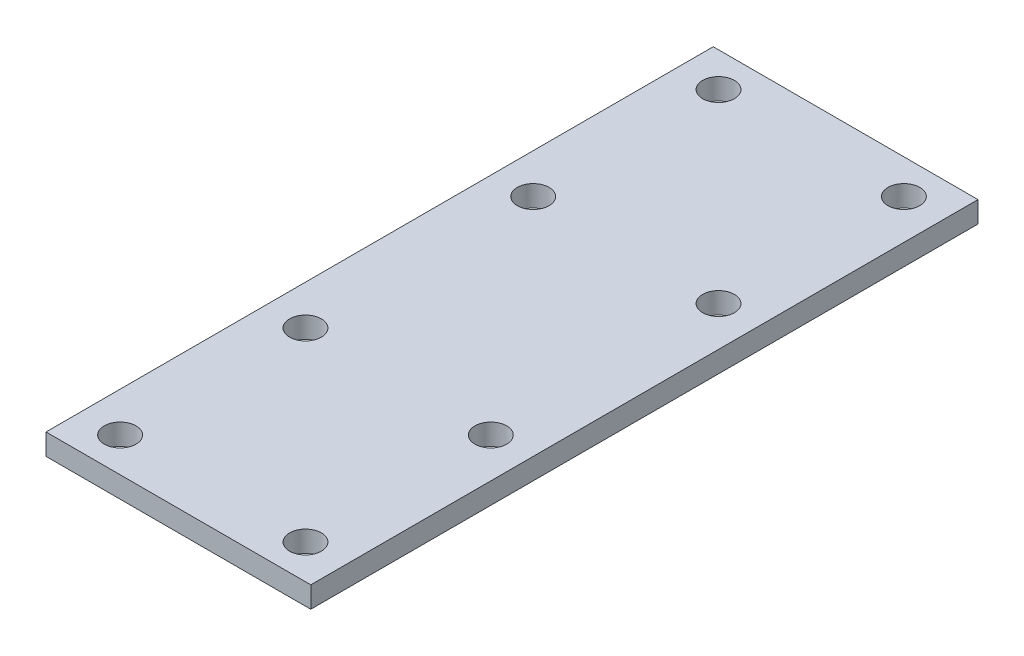
ISO-10303-21;
HEADER;
FILE_DESCRIPTION(('STEP AP214'),'2;1');
FILE_NAME('part.step','',(''),(''),'','','');
FILE_SCHEMA(('AUTOMOTIVE_DESIGN { 1 0 10303 214 1 1 1 1 }'));
ENDSEC;
DATA;
#1=APPLICATION_CONTEXT('core data for automotive mechanical design processes');
#2=APPLICATION_PROTOCOL_DEFINITION('international standard','automotive_design',2000,#1);
#3=PRODUCT_CONTEXT('',#1,'mechanical');
#4=PRODUCT('Part','Part','',(#3));
#5=PRODUCT_RELATED_PRODUCT_CATEGORY('part','',(#4));
#6=PRODUCT_DEFINITION_FORMATION('','',#4);
#7=PRODUCT_DEFINITION_CONTEXT('part definition',#1,'design');
#8=PRODUCT_DEFINITION('design','',#6,#7);
#9=PRODUCT_DEFINITION_SHAPE('','',#8);
#10=(LENGTH_UNIT() NAMED_UNIT(*) SI_UNIT(.MILLI.,.METRE.));
#11=(NAMED_UNIT(*) PLANE_ANGLE_UNIT() SI_UNIT($,.RADIAN.));
#12=(NAMED_UNIT(*) SI_UNIT($,.STERADIAN.) SOLID_ANGLE_UNIT());
#13=UNCERTAINTY_MEASURE_WITH_UNIT(LENGTH_MEASURE(1.E-05),#10,'distance_accuracy_value','');
#14=(GEOMETRIC_REPRESENTATION_CONTEXT(3) GLOBAL_UNCERTAINTY_ASSIGNED_CONTEXT((#13)) GLOBAL_UNIT_ASSIGNED_CONTEXT((#10,
#11,#12)) REPRESENTATION_CONTEXT('',''));
#15=CARTESIAN_POINT('',(0.,0.,0.));
#16=DIRECTION('',(0.,0.,1.));
#17=DIRECTION('',(1.,0.,0.));
#18=AXIS2_PLACEMENT_3D('',#15,#16,#17);
#19=CARTESIAN_POINT('',(0.,4.,0.));
#20=DIRECTION('',(0.,-1.,0.));
#21=DIRECTION('',(0.,0.,-1.));
#22=AXIS2_PLACEMENT_3D('',#19,#20,#21);
#23=PLANE('',#22);
#24=DIRECTION('',(0.,0.,1.));
#25=VECTOR('',#24,1.);
#26=CARTESIAN_POINT('',(0.,4.,0.));
#27=LINE('',#26,#25);
#28=CARTESIAN_POINT('',(0.,4.,-126.));
#29=VERTEX_POINT('',#28);
#30=CARTESIAN_POINT('',(0.,4.,0.));
#31=VERTEX_POINT('',#30);
#32=EDGE_CURVE('E89',#29,#31,#27,.T.);
#33=ORIENTED_EDGE('',*,*,#32,.T.);
#34=DIRECTION('',(1.,0.,0.));
#35=VECTOR('',#34,1.);
#36=CARTESIAN_POINT('',(0.,4.,0.));
#37=LINE('',#36,#35);
#38=CARTESIAN_POINT('',(50.,4.,0.));
#39=VERTEX_POINT('',#38);
#40=EDGE_CURVE('E84',#31,#39,#37,.T.);
#41=ORIENTED_EDGE('',*,*,#40,.T.);
#42=DIRECTION('',(0.,0.,-1.));
#43=VECTOR('',#42,1.);
#44=CARTESIAN_POINT('',(50.,4.,0.));
#45=LINE('',#44,#43);
#46=CARTESIAN_POINT('',(50.,4.,-126.));
#47=VERTEX_POINT('',#46);
#48=EDGE_CURVE('E87',#39,#47,#45,.T.);
#49=ORIENTED_EDGE('',*,*,#48,.T.);
#50=DIRECTION('',(-1.,0.,0.));
#51=VECTOR('',#50,1.);
#52=CARTESIAN_POINT('',(0.,4.,-126.));
#53=LINE('',#52,#51);
#54=EDGE_CURVE('E54',#47,#29,#53,.T.);
#55=ORIENTED_EDGE('',*,*,#54,.T.);
#56=EDGE_LOOP('',(#33,#41,#49,#55));
#57=FACE_BOUND('',#56,.T.);
#58=CARTESIAN_POINT('',(7.5,4.,-119.5));
#59=DIRECTION('',(0.,1.,0.));
#60=DIRECTION('',(0.,0.,1.));
#61=AXIS2_PLACEMENT_3D('',#58,#59,#60);
#62=CIRCLE('',#61,3.);
#63=CARTESIAN_POINT('',(7.5,4.,-116.5));
#64=VERTEX_POINT('',#63);
#65=EDGE_CURVE('E104',#64,#64,#62,.T.);
#66=ORIENTED_EDGE('',*,*,#65,.F.);
#67=EDGE_LOOP('',(#66));
#68=FACE_BOUND('',#67,.T.);
#69=CARTESIAN_POINT('',(7.50000000000001,4.,-84.5));
#70=DIRECTION('',(0.,1.,0.));
#71=DIRECTION('',(0.,0.,1.));
#72=AXIS2_PLACEMENT_3D('',#69,#70,#71);
#73=CIRCLE('',#72,3.);
#74=CARTESIAN_POINT('',(7.50000000000001,4.,-81.5));
#75=VERTEX_POINT('',#74);
#76=EDGE_CURVE('E119',#75,#75,#73,.T.);
#77=ORIENTED_EDGE('',*,*,#76,.F.);
#78=EDGE_LOOP('',(#77));
#79=FACE_BOUND('',#78,.T.);
#80=CARTESIAN_POINT('',(42.5,4.,-84.5));
#81=DIRECTION('',(0.,1.,0.));
#82=DIRECTION('',(0.,0.,-1.));
#83=AXIS2_PLACEMENT_3D('',#80,#81,#82);
#84=CIRCLE('',#83,2.99999999999999);
#85=CARTESIAN_POINT('',(42.5,4.,-87.5));
#86=VERTEX_POINT('',#85);
#87=EDGE_CURVE('E125',#86,#86,#84,.T.);
#88=ORIENTED_EDGE('',*,*,#87,.F.);
#89=EDGE_LOOP('',(#88));
#90=FACE_BOUND('',#89,.T.);
#91=CARTESIAN_POINT('',(42.5,4.,-119.5));
#92=DIRECTION('',(0.,1.,0.));
#93=DIRECTION('',(0.,0.,-1.));
#94=AXIS2_PLACEMENT_3D('',#91,#92,#93);
#95=CIRCLE('',#94,3.);
#96=CARTESIAN_POINT('',(42.5,4.,-122.5));
#97=VERTEX_POINT('',#96);
#98=EDGE_CURVE('E131',#97,#97,#95,.T.);
#99=ORIENTED_EDGE('',*,*,#98,.F.);
#100=EDGE_LOOP('',(#99));
#101=FACE_BOUND('',#100,.T.);
#102=CARTESIAN_POINT('',(7.50000000000001,4.,-41.5));
#103=DIRECTION('',(0.,1.,0.));
#104=DIRECTION('',(0.,0.,-1.));
#105=AXIS2_PLACEMENT_3D('',#102,#103,#104);
#106=CIRCLE('',#105,3.);
#107=CARTESIAN_POINT('',(7.50000000000001,4.,-44.5));
#108=VERTEX_POINT('',#107);
#109=EDGE_CURVE('E137',#108,#108,#106,.T.);
#110=ORIENTED_EDGE('',*,*,#109,.F.);
#111=EDGE_LOOP('',(#110));
#112=FACE_BOUND('',#111,.T.);
#113=CARTESIAN_POINT('',(7.5,4.,-6.50000000000001));
#114=DIRECTION('',(0.,1.,0.));
#115=DIRECTION('',(0.,0.,-1.));
#116=AXIS2_PLACEMENT_3D('',#113,#114,#115);
#117=CIRCLE('',#116,3.);
#118=CARTESIAN_POINT('',(7.5,4.,-9.50000000000001));
#119=VERTEX_POINT('',#118);
#120=EDGE_CURVE('E143',#119,#119,#117,.T.);
#121=ORIENTED_EDGE('',*,*,#120,.F.);
#122=EDGE_LOOP('',(#121));
#123=FACE_BOUND('',#122,.T.);
#124=CARTESIAN_POINT('',(42.5,4.,-6.50000000000001));
#125=DIRECTION('',(0.,1.,0.));
#126=DIRECTION('',(0.,0.,1.));
#127=AXIS2_PLACEMENT_3D('',#124,#125,#126);
#128=CIRCLE('',#127,3.);
#129=CARTESIAN_POINT('',(42.5,4.,-3.5));
#130=VERTEX_POINT('',#129);
#131=EDGE_CURVE('E149',#130,#130,#128,.T.);
#132=ORIENTED_EDGE('',*,*,#131,.F.);
#133=EDGE_LOOP('',(#132));
#134=FACE_BOUND('',#133,.T.);
#135=CARTESIAN_POINT('',(42.5,4.,-41.5));
#136=DIRECTION('',(0.,1.,0.));
#137=DIRECTION('',(0.,0.,1.));
#138=AXIS2_PLACEMENT_3D('',#135,#136,#137);
#139=CIRCLE('',#138,2.99999999999999);
#140=CARTESIAN_POINT('',(42.5,4.,-38.5));
#141=VERTEX_POINT('',#140);
#142=EDGE_CURVE('E155',#141,#141,#139,.T.);
#143=ORIENTED_EDGE('',*,*,#142,.F.);
#144=EDGE_LOOP('',(#143));
#145=FACE_BOUND('',#144,.T.);
#146=ADVANCED_FACE('F37',(#57,#68,#79,#90,#101,#112,#123,#134,#145),#23,.F.);
#147=CARTESIAN_POINT('',(0.,0.,0.));
#148=DIRECTION('',(0.,-1.,0.));
#149=DIRECTION('',(0.,0.,-1.));
#150=AXIS2_PLACEMENT_3D('',#147,#148,#149);
#151=PLANE('',#150);
#152=CARTESIAN_POINT('',(42.5,0.,-6.50000000000001));
#153=DIRECTION('',(0.,1.,0.));
#154=DIRECTION('',(0.,0.,1.));
#155=AXIS2_PLACEMENT_3D('',#152,#153,#154);
#156=CIRCLE('',#155,3.);
#157=CARTESIAN_POINT('',(42.5,0.,-3.5));
#158=VERTEX_POINT('',#157);
#159=EDGE_CURVE('E152',#158,#158,#156,.T.);
#160=ORIENTED_EDGE('',*,*,#159,.T.);
#161=EDGE_LOOP('',(#160));
#162=FACE_BOUND('',#161,.T.);
#163=CARTESIAN_POINT('',(7.50000000000001,0.,-41.5));
#164=DIRECTION('',(0.,1.,0.));
#165=DIRECTION('',(0.,0.,-1.));
#166=AXIS2_PLACEMENT_3D('',#163,#164,#165);
#167=CIRCLE('',#166,3.);
#168=CARTESIAN_POINT('',(7.50000000000001,0.,-44.5));
#169=VERTEX_POINT('',#168);
#170=EDGE_CURVE('E140',#169,#169,#167,.T.);
#171=ORIENTED_EDGE('',*,*,#170,.T.);
#172=EDGE_LOOP('',(#171));
#173=FACE_BOUND('',#172,.T.);
#174=CARTESIAN_POINT('',(42.5,0.,-84.5));
#175=DIRECTION('',(0.,1.,0.));
#176=DIRECTION('',(0.,0.,-1.));
#177=AXIS2_PLACEMENT_3D('',#174,#175,#176);
#178=CIRCLE('',#177,2.99999999999999);
#179=CARTESIAN_POINT('',(42.5,0.,-87.5));
#180=VERTEX_POINT('',#179);
#181=EDGE_CURVE('E128',#180,#180,#178,.T.);
#182=ORIENTED_EDGE('',*,*,#181,.T.);
#183=EDGE_LOOP('',(#182));
#184=FACE_BOUND('',#183,.T.);
#185=CARTESIAN_POINT('',(7.5,0.,-119.5));
#186=DIRECTION('',(0.,1.,0.));
#187=DIRECTION('',(0.,0.,1.));
#188=AXIS2_PLACEMENT_3D('',#185,#186,#187);
#189=CIRCLE('',#188,3.);
#190=CARTESIAN_POINT('',(7.5,0.,-116.5));
#191=VERTEX_POINT('',#190);
#192=EDGE_CURVE('E116',#191,#191,#189,.T.);
#193=ORIENTED_EDGE('',*,*,#192,.T.);
#194=EDGE_LOOP('',(#193));
#195=FACE_BOUND('',#194,.T.);
#196=DIRECTION('',(0.,0.,1.));
#197=VECTOR('',#196,1.);
#198=CARTESIAN_POINT('',(0.,0.,0.));
#199=LINE('',#198,#197);
#200=CARTESIAN_POINT('',(0.,0.,-126.));
#201=VERTEX_POINT('',#200);
#202=CARTESIAN_POINT('',(0.,0.,0.));
#203=VERTEX_POINT('',#202);
#204=EDGE_CURVE('E101',#201,#203,#199,.T.);
#205=ORIENTED_EDGE('',*,*,#204,.F.);
#206=DIRECTION('',(-1.,0.,0.));
#207=VECTOR('',#206,1.);
#208=CARTESIAN_POINT('',(0.,0.,-126.));
#209=LINE('',#208,#207);
#210=CARTESIAN_POINT('',(50.,0.,-126.));
#211=VERTEX_POINT('',#210);
#212=EDGE_CURVE('E77',#211,#201,#209,.T.);
#213=ORIENTED_EDGE('',*,*,#212,.F.);
#214=DIRECTION('',(0.,0.,-1.));
#215=VECTOR('',#214,1.);
#216=CARTESIAN_POINT('',(50.,0.,0.));
#217=LINE('',#216,#215);
#218=CARTESIAN_POINT('',(50.,0.,0.));
#219=VERTEX_POINT('',#218);
#220=EDGE_CURVE('E71',#219,#211,#217,.T.);
#221=ORIENTED_EDGE('',*,*,#220,.F.);
#222=DIRECTION('',(1.,0.,0.));
#223=VECTOR('',#222,1.);
#224=CARTESIAN_POINT('',(0.,0.,0.));
#225=LINE('',#224,#223);
#226=EDGE_CURVE('E93',#203,#219,#225,.T.);
#227=ORIENTED_EDGE('',*,*,#226,.F.);
#228=EDGE_LOOP('',(#205,#213,#221,#227));
#229=FACE_BOUND('',#228,.T.);
#230=CARTESIAN_POINT('',(7.50000000000001,0.,-84.5));
#231=DIRECTION('',(0.,1.,0.));
#232=DIRECTION('',(0.,0.,1.));
#233=AXIS2_PLACEMENT_3D('',#230,#231,#232);
#234=CIRCLE('',#233,3.);
#235=CARTESIAN_POINT('',(7.50000000000001,0.,-81.5));
#236=VERTEX_POINT('',#235);
#237=EDGE_CURVE('E122',#236,#236,#234,.T.);
#238=ORIENTED_EDGE('',*,*,#237,.T.);
#239=EDGE_LOOP('',(#238));
#240=FACE_BOUND('',#239,.T.);
#241=CARTESIAN_POINT('',(42.5,0.,-119.5));
#242=DIRECTION('',(0.,1.,0.));
#243=DIRECTION('',(0.,0.,-1.));
#244=AXIS2_PLACEMENT_3D('',#241,#242,#243);
#245=CIRCLE('',#244,3.);
#246=CARTESIAN_POINT('',(42.5,0.,-122.5));
#247=VERTEX_POINT('',#246);
#248=EDGE_CURVE('E134',#247,#247,#245,.T.);
#249=ORIENTED_EDGE('',*,*,#248,.T.);
#250=EDGE_LOOP('',(#249));
#251=FACE_BOUND('',#250,.T.);
#252=CARTESIAN_POINT('',(7.5,0.,-6.50000000000001));
#253=DIRECTION('',(0.,1.,0.));
#254=DIRECTION('',(0.,0.,-1.));
#255=AXIS2_PLACEMENT_3D('',#252,#253,#254);
#256=CIRCLE('',#255,3.);
#257=CARTESIAN_POINT('',(7.5,0.,-9.50000000000001));
#258=VERTEX_POINT('',#257);
#259=EDGE_CURVE('E146',#258,#258,#256,.T.);
#260=ORIENTED_EDGE('',*,*,#259,.T.);
#261=EDGE_LOOP('',(#260));
#262=FACE_BOUND('',#261,.T.);
#263=CARTESIAN_POINT('',(42.5,0.,-41.5));
#264=DIRECTION('',(0.,1.,0.));
#265=DIRECTION('',(0.,0.,1.));
#266=AXIS2_PLACEMENT_3D('',#263,#264,#265);
#267=CIRCLE('',#266,2.99999999999999);
#268=CARTESIAN_POINT('',(42.5,0.,-38.5));
#269=VERTEX_POINT('',#268);
#270=EDGE_CURVE('E158',#269,#269,#267,.T.);
#271=ORIENTED_EDGE('',*,*,#270,.T.);
#272=EDGE_LOOP('',(#271));
#273=FACE_BOUND('',#272,.T.);
#274=ADVANCED_FACE('F112',(#162,#173,#184,#195,#229,#240,#251,#262,#273),#151,.T.);
#275=CARTESIAN_POINT('',(0.,4.,0.));
#276=DIRECTION('',(1.,0.,0.));
#277=DIRECTION('',(0.,0.,-1.));
#278=AXIS2_PLACEMENT_3D('',#275,#276,#277);
#279=PLANE('',#278);
#280=ORIENTED_EDGE('',*,*,#204,.T.);
#281=DIRECTION('',(0.,-1.,0.));
#282=VECTOR('',#281,1.);
#283=CARTESIAN_POINT('',(0.,4.,0.));
#284=LINE('',#283,#282);
#285=EDGE_CURVE('E11',#31,#203,#284,.T.);
#286=ORIENTED_EDGE('',*,*,#285,.F.);
#287=ORIENTED_EDGE('',*,*,#32,.F.);
#288=DIRECTION('',(0.,-1.,0.));
#289=VECTOR('',#288,1.);
#290=CARTESIAN_POINT('',(0.,4.,-126.));
#291=LINE('',#290,#289);
#292=EDGE_CURVE('E97',#29,#201,#291,.T.);
#293=ORIENTED_EDGE('',*,*,#292,.T.);
#294=EDGE_LOOP('',(#280,#286,#287,#293));
#295=FACE_BOUND('',#294,.T.);
#296=ADVANCED_FACE('F39',(#295),#279,.F.);
#297=CARTESIAN_POINT('',(0.,4.,0.));
#298=DIRECTION('',(0.,0.,-1.));
#299=DIRECTION('',(-1.,0.,0.));
#300=AXIS2_PLACEMENT_3D('',#297,#298,#299);
#301=PLANE('',#300);
#302=ORIENTED_EDGE('',*,*,#226,.T.);
#303=DIRECTION('',(0.,-1.,0.));
#304=VECTOR('',#303,1.);
#305=CARTESIAN_POINT('',(50.,4.,0.));
#306=LINE('',#305,#304);
#307=EDGE_CURVE('E46',#39,#219,#306,.T.);
#308=ORIENTED_EDGE('',*,*,#307,.F.);
#309=ORIENTED_EDGE('',*,*,#40,.F.);
#310=ORIENTED_EDGE('',*,*,#285,.T.);
#311=EDGE_LOOP('',(#302,#308,#309,#310));
#312=FACE_BOUND('',#311,.T.);
#313=ADVANCED_FACE('F92',(#312),#301,.F.);
#314=CARTESIAN_POINT('',(50.,4.,0.));
#315=DIRECTION('',(-1.,0.,0.));
#316=DIRECTION('',(0.,0.,1.));
#317=AXIS2_PLACEMENT_3D('',#314,#315,#316);
#318=PLANE('',#317);
#319=ORIENTED_EDGE('',*,*,#220,.T.);
#320=DIRECTION('',(0.,-1.,0.));
#321=VECTOR('',#320,1.);
#322=CARTESIAN_POINT('',(50.,4.,-126.));
#323=LINE('',#322,#321);
#324=EDGE_CURVE('E94',#47,#211,#323,.T.);
#325=ORIENTED_EDGE('',*,*,#324,.F.);
#326=ORIENTED_EDGE('',*,*,#48,.F.);
#327=ORIENTED_EDGE('',*,*,#307,.T.);
#328=EDGE_LOOP('',(#319,#325,#326,#327));
#329=FACE_BOUND('',#328,.T.);
#330=ADVANCED_FACE('F95',(#329),#318,.F.);
#331=CARTESIAN_POINT('',(0.,4.,-126.));
#332=DIRECTION('',(0.,0.,1.));
#333=DIRECTION('',(1.,0.,0.));
#334=AXIS2_PLACEMENT_3D('',#331,#332,#333);
#335=PLANE('',#334);
#336=ORIENTED_EDGE('',*,*,#212,.T.);
#337=ORIENTED_EDGE('',*,*,#292,.F.);
#338=ORIENTED_EDGE('',*,*,#54,.F.);
#339=ORIENTED_EDGE('',*,*,#324,.T.);
#340=EDGE_LOOP('',(#336,#337,#338,#339));
#341=FACE_BOUND('',#340,.T.);
#342=ADVANCED_FACE('F109',(#341),#335,.F.);
#343=CARTESIAN_POINT('',(7.5,4.,-119.5));
#344=DIRECTION('',(0.,-1.,0.));
#345=DIRECTION('',(0.,0.,-1.));
#346=AXIS2_PLACEMENT_3D('',#343,#344,#345);
#347=CYLINDRICAL_SURFACE('',#346,3.);
#348=ORIENTED_EDGE('',*,*,#65,.T.);
#349=EDGE_LOOP('',(#348));
#350=FACE_BOUND('',#349,.T.);
#351=ORIENTED_EDGE('',*,*,#192,.F.);
#352=EDGE_LOOP('',(#351));
#353=FACE_BOUND('',#352,.T.);
#354=ADVANCED_FACE('F175',(#350,#353),#347,.F.);
#355=CARTESIAN_POINT('',(7.50000000000001,4.,-84.5));
#356=DIRECTION('',(0.,-1.,0.));
#357=DIRECTION('',(0.,0.,-1.));
#358=AXIS2_PLACEMENT_3D('',#355,#356,#357);
#359=CYLINDRICAL_SURFACE('',#358,3.);
#360=ORIENTED_EDGE('',*,*,#76,.T.);
#361=EDGE_LOOP('',(#360));
#362=FACE_BOUND('',#361,.T.);
#363=ORIENTED_EDGE('',*,*,#237,.F.);
#364=EDGE_LOOP('',(#363));
#365=FACE_BOUND('',#364,.T.);
#366=ADVANCED_FACE('F221',(#362,#365),#359,.F.);
#367=CARTESIAN_POINT('',(42.5,4.,-84.5));
#368=DIRECTION('',(0.,-1.,0.));
#369=DIRECTION('',(0.,0.,-1.));
#370=AXIS2_PLACEMENT_3D('',#367,#368,#369);
#371=CYLINDRICAL_SURFACE('',#370,2.99999999999999);
#372=ORIENTED_EDGE('',*,*,#87,.T.);
#373=EDGE_LOOP('',(#372));
#374=FACE_BOUND('',#373,.T.);
#375=ORIENTED_EDGE('',*,*,#181,.F.);
#376=EDGE_LOOP('',(#375));
#377=FACE_BOUND('',#376,.T.);
#378=ADVANCED_FACE('F229',(#374,#377),#371,.F.);
#379=CARTESIAN_POINT('',(42.5,4.,-119.5));
#380=DIRECTION('',(0.,-1.,0.));
#381=DIRECTION('',(0.,0.,-1.));
#382=AXIS2_PLACEMENT_3D('',#379,#380,#381);
#383=CYLINDRICAL_SURFACE('',#382,3.);
#384=ORIENTED_EDGE('',*,*,#98,.T.);
#385=EDGE_LOOP('',(#384));
#386=FACE_BOUND('',#385,.T.);
#387=ORIENTED_EDGE('',*,*,#248,.F.);
#388=EDGE_LOOP('',(#387));
#389=FACE_BOUND('',#388,.T.);
#390=ADVANCED_FACE('F237',(#386,#389),#383,.F.);
#391=CARTESIAN_POINT('',(7.50000000000001,4.,-41.5));
#392=DIRECTION('',(0.,-1.,0.));
#393=DIRECTION('',(0.,0.,-1.));
#394=AXIS2_PLACEMENT_3D('',#391,#392,#393);
#395=CYLINDRICAL_SURFACE('',#394,3.);
#396=ORIENTED_EDGE('',*,*,#109,.T.);
#397=EDGE_LOOP('',(#396));
#398=FACE_BOUND('',#397,.T.);
#399=ORIENTED_EDGE('',*,*,#170,.F.);
#400=EDGE_LOOP('',(#399));
#401=FACE_BOUND('',#400,.T.);
#402=ADVANCED_FACE('F246',(#398,#401),#395,.F.);
#403=CARTESIAN_POINT('',(7.5,4.,-6.50000000000001));
#404=DIRECTION('',(0.,-1.,0.));
#405=DIRECTION('',(0.,0.,-1.));
#406=AXIS2_PLACEMENT_3D('',#403,#404,#405);
#407=CYLINDRICAL_SURFACE('',#406,3.);
#408=ORIENTED_EDGE('',*,*,#120,.T.);
#409=EDGE_LOOP('',(#408));
#410=FACE_BOUND('',#409,.T.);
#411=ORIENTED_EDGE('',*,*,#259,.F.);
#412=EDGE_LOOP('',(#411));
#413=FACE_BOUND('',#412,.T.);
#414=ADVANCED_FACE('F255',(#410,#413),#407,.F.);
#415=CARTESIAN_POINT('',(42.5,4.,-6.50000000000001));
#416=DIRECTION('',(0.,-1.,0.));
#417=DIRECTION('',(0.,0.,-1.));
#418=AXIS2_PLACEMENT_3D('',#415,#416,#417);
#419=CYLINDRICAL_SURFACE('',#418,3.);
#420=ORIENTED_EDGE('',*,*,#131,.T.);
#421=EDGE_LOOP('',(#420));
#422=FACE_BOUND('',#421,.T.);
#423=ORIENTED_EDGE('',*,*,#159,.F.);
#424=EDGE_LOOP('',(#423));
#425=FACE_BOUND('',#424,.T.);
#426=ADVANCED_FACE('F264',(#422,#425),#419,.F.);
#427=CARTESIAN_POINT('',(42.5,4.,-41.5));
#428=DIRECTION('',(0.,-1.,0.));
#429=DIRECTION('',(0.,0.,-1.));
#430=AXIS2_PLACEMENT_3D('',#427,#428,#429);
#431=CYLINDRICAL_SURFACE('',#430,2.99999999999999);
#432=ORIENTED_EDGE('',*,*,#142,.T.);
#433=EDGE_LOOP('',(#432));
#434=FACE_BOUND('',#433,.T.);
#435=ORIENTED_EDGE('',*,*,#270,.F.);
#436=EDGE_LOOP('',(#435));
#437=FACE_BOUND('',#436,.T.);
#438=ADVANCED_FACE('F164',(#434,#437),#431,.F.);
#439=CLOSED_SHELL('',(#146,#274,#296,#313,#330,#342,#354,#366,#378,#390,#402,#414,#426,#438));
#440=MANIFOLD_SOLID_BREP('B2',#439);
#441=ADVANCED_BREP_SHAPE_REPRESENTATION('',(#18,#440),#14);
#442=SHAPE_DEFINITION_REPRESENTATION(#9,#441);
ENDSEC;
END-ISO-10303-21;
